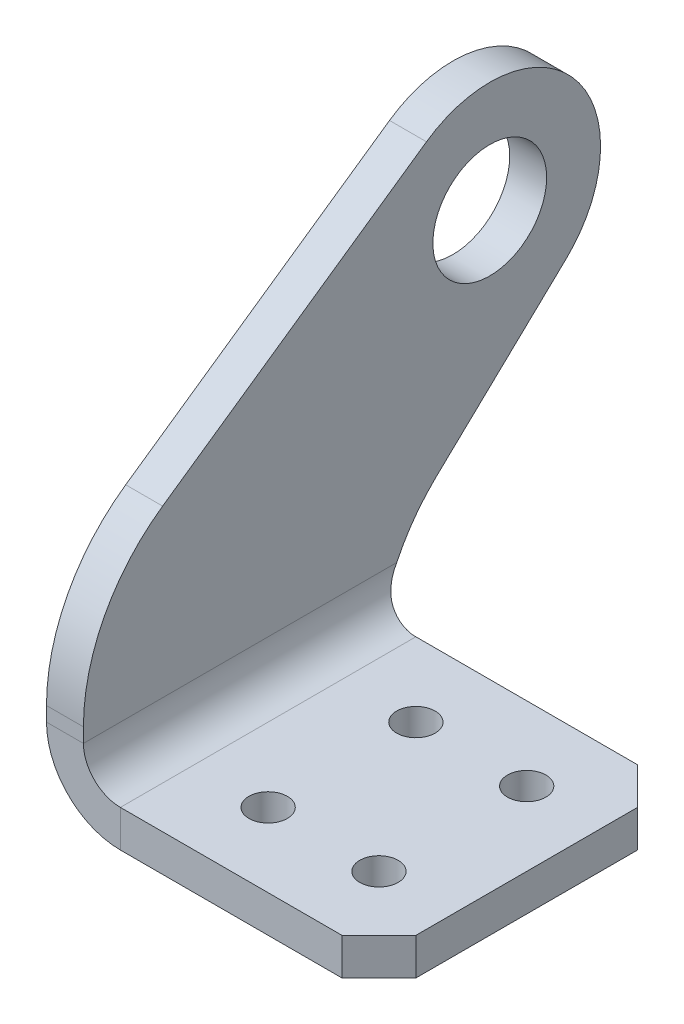
ISO-10303-21;
HEADER;
FILE_DESCRIPTION(('STEP AP214'),'2;1');
FILE_NAME('part.step','',(''),(''),'','','');
FILE_SCHEMA(('AUTOMOTIVE_DESIGN { 1 0 10303 214 1 1 1 1 }'));
ENDSEC;
DATA;
#1=APPLICATION_CONTEXT('core data for automotive mechanical design processes');
#2=APPLICATION_PROTOCOL_DEFINITION('international standard','automotive_design',2000,#1);
#3=PRODUCT_CONTEXT('',#1,'mechanical');
#4=PRODUCT('Part','Part','',(#3));
#5=PRODUCT_RELATED_PRODUCT_CATEGORY('part','',(#4));
#6=PRODUCT_DEFINITION_FORMATION('','',#4);
#7=PRODUCT_DEFINITION_CONTEXT('part definition',#1,'design');
#8=PRODUCT_DEFINITION('design','',#6,#7);
#9=PRODUCT_DEFINITION_SHAPE('','',#8);
#10=(LENGTH_UNIT() NAMED_UNIT(*) SI_UNIT(.MILLI.,.METRE.));
#11=(NAMED_UNIT(*) PLANE_ANGLE_UNIT() SI_UNIT($,.RADIAN.));
#12=(NAMED_UNIT(*) SI_UNIT($,.STERADIAN.) SOLID_ANGLE_UNIT());
#13=UNCERTAINTY_MEASURE_WITH_UNIT(LENGTH_MEASURE(1.E-05),#10,'distance_accuracy_value','');
#14=(GEOMETRIC_REPRESENTATION_CONTEXT(3) GLOBAL_UNCERTAINTY_ASSIGNED_CONTEXT((#13)) GLOBAL_UNIT_ASSIGNED_CONTEXT((#10,
#11,#12)) REPRESENTATION_CONTEXT('',''));
#15=CARTESIAN_POINT('',(0.,0.,0.));
#16=DIRECTION('',(0.,0.,1.));
#17=DIRECTION('',(1.,0.,0.));
#18=AXIS2_PLACEMENT_3D('',#15,#16,#17);
#19=CARTESIAN_POINT('',(3.175,0.,0.));
#20=DIRECTION('',(0.,0.,1.));
#21=DIRECTION('',(0.,-1.,0.));
#22=AXIS2_PLACEMENT_3D('',#19,#20,#21);
#23=PLANE('',#22);
#24=DIRECTION('',(0.,1.,0.));
#25=VECTOR('',#24,1.);
#26=CARTESIAN_POINT('',(0.,28.575,0.));
#27=LINE('',#26,#25);
#28=CARTESIAN_POINT('',(0.,7.58177696990121,0.));
#29=VERTEX_POINT('',#28);
#30=CARTESIAN_POINT('',(0.,6.35,0.));
#31=VERTEX_POINT('',#30);
#32=EDGE_CURVE('E224',#29,#31,#27,.F.);
#33=ORIENTED_EDGE('',*,*,#32,.T.);
#34=DIRECTION('',(1.,0.,0.));
#35=VECTOR('',#34,1.);
#36=CARTESIAN_POINT('',(3.175,6.35,0.));
#37=LINE('',#36,#35);
#38=CARTESIAN_POINT('',(3.175,6.35,0.));
#39=VERTEX_POINT('',#38);
#40=EDGE_CURVE('E12',#31,#39,#37,.T.);
#41=ORIENTED_EDGE('',*,*,#40,.T.);
#42=DIRECTION('',(0.,-1.,0.));
#43=VECTOR('',#42,1.);
#44=CARTESIAN_POINT('',(3.175,0.,0.));
#45=LINE('',#44,#43);
#46=CARTESIAN_POINT('',(3.175,7.58177696990121,0.));
#47=VERTEX_POINT('',#46);
#48=EDGE_CURVE('E198',#47,#39,#45,.T.);
#49=ORIENTED_EDGE('',*,*,#48,.F.);
#50=DIRECTION('',(1.,0.,0.));
#51=VECTOR('',#50,1.);
#52=CARTESIAN_POINT('',(3.175,7.58177696990121,0.));
#53=LINE('',#52,#51);
#54=EDGE_CURVE('E216',#29,#47,#53,.T.);
#55=ORIENTED_EDGE('',*,*,#54,.F.);
#56=EDGE_LOOP('',(#33,#41,#49,#55));
#57=FACE_BOUND('',#56,.T.);
#58=ADVANCED_FACE('F51',(#57),#23,.T.);
#59=CARTESIAN_POINT('',(3.175,15.875,0.));
#60=DIRECTION('',(0.,0.820808711597316,0.57120316785357));
#61=DIRECTION('',(0.,-0.57120316785357,0.820808711597316));
#62=AXIS2_PLACEMENT_3D('',#59,#60,#61);
#63=PLANE('',#62);
#64=DIRECTION('',(0.,-0.57120316785357,0.820808711597316));
#65=VECTOR('',#64,1.);
#66=CARTESIAN_POINT('',(3.175,15.875,0.));
#67=LINE('',#66,#65);
#68=CARTESIAN_POINT('',(3.175,36.3932029779644,-29.4842898261947));
#69=VERTEX_POINT('',#68);
#70=CARTESIAN_POINT('',(3.175,20.6121152665086,-6.80714971032458));
#71=VERTEX_POINT('',#70);
#72=EDGE_CURVE('E279',#69,#71,#67,.T.);
#73=ORIENTED_EDGE('',*,*,#72,.F.);
#74=DIRECTION('',(1.,0.,0.));
#75=VECTOR('',#74,1.);
#76=CARTESIAN_POINT('',(3.175,36.3932029779644,-29.4842898261947));
#77=LINE('',#76,#75);
#78=CARTESIAN_POINT('',(0.,36.3932029779644,-29.4842898261947));
#79=VERTEX_POINT('',#78);
#80=EDGE_CURVE('E251',#79,#69,#77,.T.);
#81=ORIENTED_EDGE('',*,*,#80,.F.);
#82=DIRECTION('',(0.,-0.57120316785357,0.820808711597316));
#83=VECTOR('',#82,1.);
#84=CARTESIAN_POINT('',(0.,15.875,0.));
#85=LINE('',#84,#83);
#86=CARTESIAN_POINT('',(0.,20.6121152665086,-6.80714971032458));
#87=VERTEX_POINT('',#86);
#88=EDGE_CURVE('E234',#79,#87,#85,.T.);
#89=ORIENTED_EDGE('',*,*,#88,.T.);
#90=DIRECTION('',(1.,0.,0.));
#91=VECTOR('',#90,1.);
#92=CARTESIAN_POINT('',(3.175,20.6121152665086,-6.80714971032458));
#93=LINE('',#92,#91);
#94=EDGE_CURVE('E200',#71,#87,#93,.F.);
#95=ORIENTED_EDGE('',*,*,#94,.F.);
#96=EDGE_LOOP('',(#73,#81,#89,#95));
#97=FACE_BOUND('',#96,.T.);
#98=ADVANCED_FACE('F263',(#97),#63,.T.);
#99=CARTESIAN_POINT('',(3.175,28.575,-34.925));
#100=DIRECTION('',(-1.,0.,0.));
#101=DIRECTION('',(0.,0.,-1.));
#102=AXIS2_PLACEMENT_3D('',#99,#100,#101);
#103=CYLINDRICAL_SURFACE('',#102,9.525);
#104=ORIENTED_EDGE('',*,*,#80,.T.);
#105=CARTESIAN_POINT('',(3.175,28.575,-34.925));
#106=DIRECTION('',(1.,0.,0.));
#107=DIRECTION('',(0.,0.,-1.));
#108=AXIS2_PLACEMENT_3D('',#105,#106,#107);
#109=CIRCLE('',#108,9.525);
#110=CARTESIAN_POINT('',(3.175,21.6775862068965,-41.4939655172414));
#111=VERTEX_POINT('',#110);
#112=EDGE_CURVE('E269',#111,#69,#109,.T.);
#113=ORIENTED_EDGE('',*,*,#112,.F.);
#114=DIRECTION('',(1.,0.,0.));
#115=VECTOR('',#114,1.);
#116=CARTESIAN_POINT('',(3.175,21.6775862068965,-41.4939655172414));
#117=LINE('',#116,#115);
#118=CARTESIAN_POINT('',(0.,21.6775862068965,-41.4939655172414));
#119=VERTEX_POINT('',#118);
#120=EDGE_CURVE('E248',#119,#111,#117,.T.);
#121=ORIENTED_EDGE('',*,*,#120,.F.);
#122=CARTESIAN_POINT('',(0.,28.575,-34.925));
#123=DIRECTION('',(1.,0.,0.));
#124=DIRECTION('',(0.,0.,-1.));
#125=AXIS2_PLACEMENT_3D('',#122,#123,#124);
#126=CIRCLE('',#125,9.525);
#127=EDGE_CURVE('E238',#119,#79,#126,.T.);
#128=ORIENTED_EDGE('',*,*,#127,.T.);
#129=EDGE_LOOP('',(#104,#113,#121,#128));
#130=FACE_BOUND('',#129,.T.);
#131=ADVANCED_FACE('F268',(#130),#103,.T.);
#132=CARTESIAN_POINT('',(3.175,6.35,-25.4));
#133=DIRECTION('',(0.,-0.724137931034483,-0.689655172413793));
#134=DIRECTION('',(0.,0.689655172413793,-0.724137931034483));
#135=AXIS2_PLACEMENT_3D('',#132,#133,#134);
#136=PLANE('',#135);
#137=DIRECTION('',(0.,0.689655172413793,-0.724137931034483));
#138=VECTOR('',#137,1.);
#139=CARTESIAN_POINT('',(0.,6.35,-25.4));
#140=LINE('',#139,#138);
#141=CARTESIAN_POINT('',(0.,11.042118226601,-30.326724137931));
#142=VERTEX_POINT('',#141);
#143=EDGE_CURVE('E247',#142,#119,#140,.T.);
#144=ORIENTED_EDGE('',*,*,#143,.T.);
#145=ORIENTED_EDGE('',*,*,#120,.T.);
#146=DIRECTION('',(0.,0.689655172413793,-0.724137931034483));
#147=VECTOR('',#146,1.);
#148=CARTESIAN_POINT('',(3.175,6.35,-25.4));
#149=LINE('',#148,#147);
#150=CARTESIAN_POINT('',(3.175,11.042118226601,-30.326724137931));
#151=VERTEX_POINT('',#150);
#152=EDGE_CURVE('E272',#151,#111,#149,.T.);
#153=ORIENTED_EDGE('',*,*,#152,.F.);
#154=DIRECTION('',(1.,0.,0.));
#155=VECTOR('',#154,1.);
#156=CARTESIAN_POINT('',(3.175,11.042118226601,-30.326724137931));
#157=LINE('',#156,#155);
#158=EDGE_CURVE('E190',#142,#151,#157,.T.);
#159=ORIENTED_EDGE('',*,*,#158,.F.);
#160=EDGE_LOOP('',(#144,#145,#153,#159));
#161=FACE_BOUND('',#160,.T.);
#162=ADVANCED_FACE('F271',(#161),#136,.T.);
#163=CARTESIAN_POINT('',(3.175,28.575,-34.925));
#164=DIRECTION('',(-1.,0.,0.));
#165=DIRECTION('',(0.,0.,-1.));
#166=AXIS2_PLACEMENT_3D('',#163,#164,#165);
#167=CYLINDRICAL_SURFACE('',#166,4.8895);
#168=CARTESIAN_POINT('',(3.175,28.575,-34.925));
#169=DIRECTION('',(1.,0.,0.));
#170=DIRECTION('',(0.,0.,-1.));
#171=AXIS2_PLACEMENT_3D('',#168,#169,#170);
#172=CIRCLE('',#171,4.8895);
#173=CARTESIAN_POINT('',(3.175,28.575,-39.8145));
#174=VERTEX_POINT('',#173);
#175=EDGE_CURVE('E252',#174,#174,#172,.T.);
#176=ORIENTED_EDGE('',*,*,#175,.T.);
#177=EDGE_LOOP('',(#176));
#178=FACE_BOUND('',#177,.T.);
#179=CARTESIAN_POINT('',(0.,28.575,-34.925));
#180=DIRECTION('',(1.,0.,0.));
#181=DIRECTION('',(0.,0.,-1.));
#182=AXIS2_PLACEMENT_3D('',#179,#180,#181);
#183=CIRCLE('',#182,4.8895);
#184=CARTESIAN_POINT('',(0.,28.575,-39.8145));
#185=VERTEX_POINT('',#184);
#186=EDGE_CURVE('E244',#185,#185,#183,.T.);
#187=ORIENTED_EDGE('',*,*,#186,.F.);
#188=EDGE_LOOP('',(#187));
#189=FACE_BOUND('',#188,.T.);
#190=ADVANCED_FACE('F477',(#178,#189),#167,.F.);
#191=CARTESIAN_POINT('',(3.175,28.575,-34.925));
#192=DIRECTION('',(-1.,0.,0.));
#193=DIRECTION('',(0.,0.,-1.));
#194=AXIS2_PLACEMENT_3D('',#191,#192,#193);
#195=PLANE('',#194);
#196=ORIENTED_EDGE('',*,*,#48,.T.);
#197=DIRECTION('',(0.,0.,1.));
#198=VECTOR('',#197,1.);
#199=CARTESIAN_POINT('',(3.175,6.35,-34.925));
#200=LINE('',#199,#198);
#201=CARTESIAN_POINT('',(3.175,6.35,-26.9318120413791));
#202=VERTEX_POINT('',#201);
#203=EDGE_CURVE('E162',#202,#39,#200,.T.);
#204=ORIENTED_EDGE('',*,*,#203,.F.);
#205=CARTESIAN_POINT('',(3.175,-0.453571428571434,-41.275));
#206=DIRECTION('',(1.,0.,0.));
#207=DIRECTION('',(0.,1.,0.));
#208=AXIS2_PLACEMENT_3D('',#205,#206,#207);
#209=CIRCLE('',#208,15.875);
#210=EDGE_CURVE('E188',#151,#202,#209,.T.);
#211=ORIENTED_EDGE('',*,*,#210,.F.);
#212=ORIENTED_EDGE('',*,*,#152,.T.);
#213=ORIENTED_EDGE('',*,*,#112,.T.);
#214=ORIENTED_EDGE('',*,*,#72,.T.);
#215=CARTESIAN_POINT('',(3.175,7.58177696990121,-15.875));
#216=DIRECTION('',(1.,0.,0.));
#217=DIRECTION('',(0.,1.,0.));
#218=AXIS2_PLACEMENT_3D('',#215,#216,#217);
#219=CIRCLE('',#218,15.875);
#220=EDGE_CURVE('E76',#47,#71,#219,.F.);
#221=ORIENTED_EDGE('',*,*,#220,.F.);
#222=EDGE_LOOP('',(#196,#204,#211,#212,#213,#214,#221));
#223=FACE_BOUND('',#222,.T.);
#224=ORIENTED_EDGE('',*,*,#175,.F.);
#225=EDGE_LOOP('',(#224));
#226=FACE_BOUND('',#225,.T.);
#227=ADVANCED_FACE('F195',(#223,#226),#195,.F.);
#228=CARTESIAN_POINT('',(0.,28.575,-34.925));
#229=DIRECTION('',(-1.,0.,0.));
#230=DIRECTION('',(0.,0.,-1.));
#231=AXIS2_PLACEMENT_3D('',#228,#229,#230);
#232=PLANE('',#231);
#233=ORIENTED_EDGE('',*,*,#88,.F.);
#234=ORIENTED_EDGE('',*,*,#127,.F.);
#235=ORIENTED_EDGE('',*,*,#143,.F.);
#236=CARTESIAN_POINT('',(0.,-0.453571428571434,-41.275));
#237=DIRECTION('',(1.,0.,0.));
#238=DIRECTION('',(0.,1.,0.));
#239=AXIS2_PLACEMENT_3D('',#236,#237,#238);
#240=CIRCLE('',#239,15.875);
#241=CARTESIAN_POINT('',(0.,6.35,-26.9318120413791));
#242=VERTEX_POINT('',#241);
#243=EDGE_CURVE('E193',#242,#142,#240,.F.);
#244=ORIENTED_EDGE('',*,*,#243,.F.);
#245=DIRECTION('',(0.,0.,1.));
#246=VECTOR('',#245,1.);
#247=CARTESIAN_POINT('',(0.,6.35,-34.925));
#248=LINE('',#247,#246);
#249=EDGE_CURVE('E61',#242,#31,#248,.T.);
#250=ORIENTED_EDGE('',*,*,#249,.T.);
#251=ORIENTED_EDGE('',*,*,#32,.F.);
#252=CARTESIAN_POINT('',(0.,7.58177696990121,-15.875));
#253=DIRECTION('',(1.,0.,0.));
#254=DIRECTION('',(0.,1.,0.));
#255=AXIS2_PLACEMENT_3D('',#252,#253,#254);
#256=CIRCLE('',#255,15.875);
#257=EDGE_CURVE('E69',#87,#29,#256,.T.);
#258=ORIENTED_EDGE('',*,*,#257,.F.);
#259=EDGE_LOOP('',(#233,#234,#235,#244,#250,#251,#258));
#260=FACE_BOUND('',#259,.T.);
#261=ORIENTED_EDGE('',*,*,#186,.T.);
#262=EDGE_LOOP('',(#261));
#263=FACE_BOUND('',#262,.T.);
#264=ADVANCED_FACE('F221',(#260,#263),#232,.T.);
#265=CARTESIAN_POINT('',(3.175,-0.453571428571434,-41.275));
#266=DIRECTION('',(-1.,0.,0.));
#267=DIRECTION('',(0.,1.,0.));
#268=AXIS2_PLACEMENT_3D('',#265,#266,#267);
#269=CYLINDRICAL_SURFACE('',#268,15.875);
#270=CARTESIAN_POINT('',(0.,6.35,-26.9318120413791));
#271=CARTESIAN_POINT('',(3.175,6.35,-26.9318120413791));
#272=B_SPLINE_CURVE_WITH_KNOTS('',1,(#270,#271),.UNSPECIFIED.,.F.,.F.,(2,2),(0.,1.),.UNSPECIFIED.);
#273=EDGE_CURVE('E175',#202,#242,#272,.F.);
#274=ORIENTED_EDGE('',*,*,#273,.T.);
#275=ORIENTED_EDGE('',*,*,#243,.T.);
#276=ORIENTED_EDGE('',*,*,#158,.T.);
#277=ORIENTED_EDGE('',*,*,#210,.T.);
#278=EDGE_LOOP('',(#274,#275,#276,#277));
#279=FACE_BOUND('',#278,.T.);
#280=ADVANCED_FACE('F53',(#279),#269,.F.);
#281=CARTESIAN_POINT('',(3.175,7.58177696990121,-15.875));
#282=DIRECTION('',(1.,0.,0.));
#283=DIRECTION('',(0.,-1.,0.));
#284=AXIS2_PLACEMENT_3D('',#281,#282,#283);
#285=CYLINDRICAL_SURFACE('',#284,15.875);
#286=ORIENTED_EDGE('',*,*,#257,.T.);
#287=ORIENTED_EDGE('',*,*,#54,.T.);
#288=ORIENTED_EDGE('',*,*,#220,.T.);
#289=ORIENTED_EDGE('',*,*,#94,.T.);
#290=EDGE_LOOP('',(#286,#287,#288,#289));
#291=FACE_BOUND('',#290,.T.);
#292=ADVANCED_FACE('F258',(#291),#285,.T.);
#293=CARTESIAN_POINT('',(25.4,3.175,0.));
#294=DIRECTION('',(0.707106781186547,0.,0.707106781186548));
#295=DIRECTION('',(-0.707106781186548,0.,0.707106781186547));
#296=AXIS2_PLACEMENT_3D('',#293,#294,#295);
#297=PLANE('',#296);
#298=DIRECTION('',(0.,1.,0.));
#299=VECTOR('',#298,1.);
#300=CARTESIAN_POINT('',(28.575,3.175,-3.175));
#301=LINE('',#300,#299);
#302=CARTESIAN_POINT('',(28.575,0.,-3.175));
#303=VERTEX_POINT('',#302);
#304=CARTESIAN_POINT('',(28.575,3.175,-3.175));
#305=VERTEX_POINT('',#304);
#306=EDGE_CURVE('E297',#303,#305,#301,.T.);
#307=ORIENTED_EDGE('',*,*,#306,.T.);
#308=DIRECTION('',(-0.707106781186548,0.,0.707106781186547));
#309=VECTOR('',#308,1.);
#310=CARTESIAN_POINT('',(25.4,3.175,0.));
#311=LINE('',#310,#309);
#312=CARTESIAN_POINT('',(25.4,3.175,0.));
#313=VERTEX_POINT('',#312);
#314=EDGE_CURVE('E328',#305,#313,#311,.T.);
#315=ORIENTED_EDGE('',*,*,#314,.T.);
#316=DIRECTION('',(0.,1.,0.));
#317=VECTOR('',#316,1.);
#318=CARTESIAN_POINT('',(25.4,3.175,0.));
#319=LINE('',#318,#317);
#320=CARTESIAN_POINT('',(25.4,0.,0.));
#321=VERTEX_POINT('',#320);
#322=EDGE_CURVE('E292',#321,#313,#319,.T.);
#323=ORIENTED_EDGE('',*,*,#322,.F.);
#324=DIRECTION('',(-0.707106781186548,0.,0.707106781186547));
#325=VECTOR('',#324,1.);
#326=CARTESIAN_POINT('',(25.4,0.,0.));
#327=LINE('',#326,#325);
#328=EDGE_CURVE('E289',#303,#321,#327,.T.);
#329=ORIENTED_EDGE('',*,*,#328,.F.);
#330=EDGE_LOOP('',(#307,#315,#323,#329));
#331=FACE_BOUND('',#330,.T.);
#332=ADVANCED_FACE('F450',(#331),#297,.T.);
#333=CARTESIAN_POINT('',(28.575,3.175,-3.175));
#334=DIRECTION('',(1.,0.,0.));
#335=DIRECTION('',(0.,0.,1.));
#336=AXIS2_PLACEMENT_3D('',#333,#334,#335);
#337=PLANE('',#336);
#338=DIRECTION('',(0.,1.,0.));
#339=VECTOR('',#338,1.);
#340=CARTESIAN_POINT('',(28.575,3.175,-22.225));
#341=LINE('',#340,#339);
#342=CARTESIAN_POINT('',(28.575,0.,-22.225));
#343=VERTEX_POINT('',#342);
#344=CARTESIAN_POINT('',(28.575,3.175,-22.225));
#345=VERTEX_POINT('',#344);
#346=EDGE_CURVE('E302',#343,#345,#341,.T.);
#347=ORIENTED_EDGE('',*,*,#346,.T.);
#348=DIRECTION('',(0.,0.,1.));
#349=VECTOR('',#348,1.);
#350=CARTESIAN_POINT('',(28.575,3.175,-3.175));
#351=LINE('',#350,#349);
#352=EDGE_CURVE('E326',#345,#305,#351,.T.);
#353=ORIENTED_EDGE('',*,*,#352,.T.);
#354=ORIENTED_EDGE('',*,*,#306,.F.);
#355=DIRECTION('',(0.,0.,1.));
#356=VECTOR('',#355,1.);
#357=CARTESIAN_POINT('',(28.575,0.,0.));
#358=LINE('',#357,#356);
#359=EDGE_CURVE('E295',#343,#303,#358,.T.);
#360=ORIENTED_EDGE('',*,*,#359,.F.);
#361=EDGE_LOOP('',(#347,#353,#354,#360));
#362=FACE_BOUND('',#361,.T.);
#363=ADVANCED_FACE('F447',(#362),#337,.T.);
#364=CARTESIAN_POINT('',(25.4,3.175,-25.4));
#365=DIRECTION('',(0.707106781186548,0.,-0.707106781186548));
#366=DIRECTION('',(0.707106781186547,0.,0.707106781186547));
#367=AXIS2_PLACEMENT_3D('',#364,#365,#366);
#368=PLANE('',#367);
#369=DIRECTION('',(0.,1.,0.));
#370=VECTOR('',#369,1.);
#371=CARTESIAN_POINT('',(25.4,3.175,-25.4));
#372=LINE('',#371,#370);
#373=CARTESIAN_POINT('',(25.4,0.,-25.4));
#374=VERTEX_POINT('',#373);
#375=CARTESIAN_POINT('',(25.4,3.175,-25.4));
#376=VERTEX_POINT('',#375);
#377=EDGE_CURVE('E333',#374,#376,#372,.T.);
#378=ORIENTED_EDGE('',*,*,#377,.T.);
#379=DIRECTION('',(0.707106781186547,0.,0.707106781186547));
#380=VECTOR('',#379,1.);
#381=CARTESIAN_POINT('',(25.4,3.175,-25.4));
#382=LINE('',#381,#380);
#383=EDGE_CURVE('E324',#376,#345,#382,.T.);
#384=ORIENTED_EDGE('',*,*,#383,.T.);
#385=ORIENTED_EDGE('',*,*,#346,.F.);
#386=DIRECTION('',(0.707106781186547,0.,0.707106781186547));
#387=VECTOR('',#386,1.);
#388=CARTESIAN_POINT('',(25.4,0.,-25.4));
#389=LINE('',#388,#387);
#390=EDGE_CURVE('E300',#374,#343,#389,.T.);
#391=ORIENTED_EDGE('',*,*,#390,.F.);
#392=EDGE_LOOP('',(#378,#384,#385,#391));
#393=FACE_BOUND('',#392,.T.);
#394=ADVANCED_FACE('F440',(#393),#368,.T.);
#395=CARTESIAN_POINT('',(22.225,3.175,-6.35));
#396=DIRECTION('',(0.,1.,0.));
#397=DIRECTION('',(0.,0.,1.));
#398=AXIS2_PLACEMENT_3D('',#395,#396,#397);
#399=CYLINDRICAL_SURFACE('',#398,1.651);
#400=CARTESIAN_POINT('',(22.225,0.,-6.35));
#401=DIRECTION('',(0.,-1.,0.));
#402=DIRECTION('',(0.,0.,1.));
#403=AXIS2_PLACEMENT_3D('',#400,#401,#402);
#404=CIRCLE('',#403,1.651);
#405=CARTESIAN_POINT('',(22.225,0.,-4.699));
#406=VERTEX_POINT('',#405);
#407=EDGE_CURVE('E345',#406,#406,#404,.T.);
#408=ORIENTED_EDGE('',*,*,#407,.T.);
#409=EDGE_LOOP('',(#408));
#410=FACE_BOUND('',#409,.T.);
#411=CARTESIAN_POINT('',(22.225,3.175,-6.35));
#412=DIRECTION('',(0.,-1.,0.));
#413=DIRECTION('',(0.,0.,1.));
#414=AXIS2_PLACEMENT_3D('',#411,#412,#413);
#415=CIRCLE('',#414,1.651);
#416=CARTESIAN_POINT('',(22.225,3.175,-4.699));
#417=VERTEX_POINT('',#416);
#418=EDGE_CURVE('E305',#417,#417,#415,.T.);
#419=ORIENTED_EDGE('',*,*,#418,.F.);
#420=EDGE_LOOP('',(#419));
#421=FACE_BOUND('',#420,.T.);
#422=ADVANCED_FACE('F567',(#410,#421),#399,.F.);
#423=CARTESIAN_POINT('',(12.7,3.175,-6.35));
#424=DIRECTION('',(0.,1.,0.));
#425=DIRECTION('',(0.,0.,1.));
#426=AXIS2_PLACEMENT_3D('',#423,#424,#425);
#427=CYLINDRICAL_SURFACE('',#426,1.651);
#428=CARTESIAN_POINT('',(12.7,0.,-6.35));
#429=DIRECTION('',(0.,-1.,0.));
#430=DIRECTION('',(0.,0.,1.));
#431=AXIS2_PLACEMENT_3D('',#428,#429,#430);
#432=CIRCLE('',#431,1.651);
#433=CARTESIAN_POINT('',(12.7,0.,-4.699));
#434=VERTEX_POINT('',#433);
#435=EDGE_CURVE('E342',#434,#434,#432,.T.);
#436=ORIENTED_EDGE('',*,*,#435,.T.);
#437=EDGE_LOOP('',(#436));
#438=FACE_BOUND('',#437,.T.);
#439=CARTESIAN_POINT('',(12.7,3.175,-6.35));
#440=DIRECTION('',(0.,-1.,0.));
#441=DIRECTION('',(0.,0.,1.));
#442=AXIS2_PLACEMENT_3D('',#439,#440,#441);
#443=CIRCLE('',#442,1.651);
#444=CARTESIAN_POINT('',(12.7,3.175,-4.699));
#445=VERTEX_POINT('',#444);
#446=EDGE_CURVE('E308',#445,#445,#443,.T.);
#447=ORIENTED_EDGE('',*,*,#446,.F.);
#448=EDGE_LOOP('',(#447));
#449=FACE_BOUND('',#448,.T.);
#450=ADVANCED_FACE('F581',(#438,#449),#427,.F.);
#451=CARTESIAN_POINT('',(12.7,3.175,-19.05));
#452=DIRECTION('',(0.,1.,0.));
#453=DIRECTION('',(0.,0.,1.));
#454=AXIS2_PLACEMENT_3D('',#451,#452,#453);
#455=CYLINDRICAL_SURFACE('',#454,1.651);
#456=CARTESIAN_POINT('',(12.7,0.,-19.05));
#457=DIRECTION('',(0.,-1.,0.));
#458=DIRECTION('',(0.,0.,1.));
#459=AXIS2_PLACEMENT_3D('',#456,#457,#458);
#460=CIRCLE('',#459,1.651);
#461=CARTESIAN_POINT('',(12.7,0.,-17.399));
#462=VERTEX_POINT('',#461);
#463=EDGE_CURVE('E339',#462,#462,#460,.T.);
#464=ORIENTED_EDGE('',*,*,#463,.T.);
#465=EDGE_LOOP('',(#464));
#466=FACE_BOUND('',#465,.T.);
#467=CARTESIAN_POINT('',(12.7,3.175,-19.05));
#468=DIRECTION('',(0.,-1.,0.));
#469=DIRECTION('',(0.,0.,1.));
#470=AXIS2_PLACEMENT_3D('',#467,#468,#469);
#471=CIRCLE('',#470,1.651);
#472=CARTESIAN_POINT('',(12.7,3.175,-17.399));
#473=VERTEX_POINT('',#472);
#474=EDGE_CURVE('E311',#473,#473,#471,.T.);
#475=ORIENTED_EDGE('',*,*,#474,.F.);
#476=EDGE_LOOP('',(#475));
#477=FACE_BOUND('',#476,.T.);
#478=ADVANCED_FACE('F465',(#466,#477),#455,.F.);
#479=CARTESIAN_POINT('',(22.225,3.175,-19.05));
#480=DIRECTION('',(0.,1.,0.));
#481=DIRECTION('',(0.,0.,1.));
#482=AXIS2_PLACEMENT_3D('',#479,#480,#481);
#483=CYLINDRICAL_SURFACE('',#482,1.651);
#484=CARTESIAN_POINT('',(22.225,0.,-19.05));
#485=DIRECTION('',(0.,-1.,0.));
#486=DIRECTION('',(0.,0.,1.));
#487=AXIS2_PLACEMENT_3D('',#484,#485,#486);
#488=CIRCLE('',#487,1.651);
#489=CARTESIAN_POINT('',(22.225,0.,-17.399));
#490=VERTEX_POINT('',#489);
#491=EDGE_CURVE('E336',#490,#490,#488,.T.);
#492=ORIENTED_EDGE('',*,*,#491,.T.);
#493=EDGE_LOOP('',(#492));
#494=FACE_BOUND('',#493,.T.);
#495=CARTESIAN_POINT('',(22.225,3.175,-19.05));
#496=DIRECTION('',(0.,-1.,0.));
#497=DIRECTION('',(0.,0.,1.));
#498=AXIS2_PLACEMENT_3D('',#495,#496,#497);
#499=CIRCLE('',#498,1.651);
#500=CARTESIAN_POINT('',(22.225,3.175,-17.399));
#501=VERTEX_POINT('',#500);
#502=EDGE_CURVE('E314',#501,#501,#499,.T.);
#503=ORIENTED_EDGE('',*,*,#502,.F.);
#504=EDGE_LOOP('',(#503));
#505=FACE_BOUND('',#504,.T.);
#506=ADVANCED_FACE('F457',(#494,#505),#483,.F.);
#507=CARTESIAN_POINT('',(0.,3.175,0.));
#508=DIRECTION('',(0.,1.,0.));
#509=DIRECTION('',(0.,0.,1.));
#510=AXIS2_PLACEMENT_3D('',#507,#508,#509);
#511=PLANE('',#510);
#512=ORIENTED_EDGE('',*,*,#502,.T.);
#513=EDGE_LOOP('',(#512));
#514=FACE_BOUND('',#513,.T.);
#515=ORIENTED_EDGE('',*,*,#474,.T.);
#516=EDGE_LOOP('',(#515));
#517=FACE_BOUND('',#516,.T.);
#518=ORIENTED_EDGE('',*,*,#446,.T.);
#519=EDGE_LOOP('',(#518));
#520=FACE_BOUND('',#519,.T.);
#521=ORIENTED_EDGE('',*,*,#418,.T.);
#522=EDGE_LOOP('',(#521));
#523=FACE_BOUND('',#522,.T.);
#524=DIRECTION('',(-1.,0.,0.));
#525=VECTOR('',#524,1.);
#526=CARTESIAN_POINT('',(0.,3.175,0.));
#527=LINE('',#526,#525);
#528=CARTESIAN_POINT('',(6.35,3.175,0.));
#529=VERTEX_POINT('',#528);
#530=EDGE_CURVE('E317',#313,#529,#527,.T.);
#531=ORIENTED_EDGE('',*,*,#530,.F.);
#532=ORIENTED_EDGE('',*,*,#314,.F.);
#533=ORIENTED_EDGE('',*,*,#352,.F.);
#534=ORIENTED_EDGE('',*,*,#383,.F.);
#535=DIRECTION('',(1.,0.,0.));
#536=VECTOR('',#535,1.);
#537=CARTESIAN_POINT('',(0.,3.175,-25.4));
#538=LINE('',#537,#536);
#539=CARTESIAN_POINT('',(6.35,3.175,-25.4));
#540=VERTEX_POINT('',#539);
#541=EDGE_CURVE('E322',#540,#376,#538,.T.);
#542=ORIENTED_EDGE('',*,*,#541,.F.);
#543=DIRECTION('',(0.,0.,-1.));
#544=VECTOR('',#543,1.);
#545=CARTESIAN_POINT('',(6.35,3.175,0.));
#546=LINE('',#545,#544);
#547=EDGE_CURVE('E320',#529,#540,#546,.T.);
#548=ORIENTED_EDGE('',*,*,#547,.F.);
#549=EDGE_LOOP('',(#531,#532,#533,#534,#542,#548));
#550=FACE_BOUND('',#549,.T.);
#551=ADVANCED_FACE('F455',(#514,#517,#520,#523,#550),#511,.T.);
#552=CARTESIAN_POINT('',(0.,3.175,-25.4));
#553=DIRECTION('',(0.,0.,-1.));
#554=DIRECTION('',(1.,0.,0.));
#555=AXIS2_PLACEMENT_3D('',#552,#553,#554);
#556=PLANE('',#555);
#557=DIRECTION('',(0.,1.,0.));
#558=VECTOR('',#557,1.);
#559=CARTESIAN_POINT('',(6.35,3.175,-25.4));
#560=LINE('',#559,#558);
#561=CARTESIAN_POINT('',(6.35,0.,-25.4));
#562=VERTEX_POINT('',#561);
#563=EDGE_CURVE('E285',#562,#540,#560,.T.);
#564=ORIENTED_EDGE('',*,*,#563,.T.);
#565=ORIENTED_EDGE('',*,*,#541,.T.);
#566=ORIENTED_EDGE('',*,*,#377,.F.);
#567=DIRECTION('',(-1.,0.,0.));
#568=VECTOR('',#567,1.);
#569=CARTESIAN_POINT('',(0.,0.,-25.4));
#570=LINE('',#569,#568);
#571=EDGE_CURVE('E331',#562,#374,#570,.F.);
#572=ORIENTED_EDGE('',*,*,#571,.F.);
#573=EDGE_LOOP('',(#564,#565,#566,#572));
#574=FACE_BOUND('',#573,.T.);
#575=ADVANCED_FACE('F436',(#574),#556,.T.);
#576=CARTESIAN_POINT('',(0.,0.,0.));
#577=DIRECTION('',(0.,1.,0.));
#578=DIRECTION('',(0.,0.,1.));
#579=AXIS2_PLACEMENT_3D('',#576,#577,#578);
#580=PLANE('',#579);
#581=ORIENTED_EDGE('',*,*,#491,.F.);
#582=EDGE_LOOP('',(#581));
#583=FACE_BOUND('',#582,.T.);
#584=ORIENTED_EDGE('',*,*,#463,.F.);
#585=EDGE_LOOP('',(#584));
#586=FACE_BOUND('',#585,.T.);
#587=ORIENTED_EDGE('',*,*,#435,.F.);
#588=EDGE_LOOP('',(#587));
#589=FACE_BOUND('',#588,.T.);
#590=ORIENTED_EDGE('',*,*,#407,.F.);
#591=EDGE_LOOP('',(#590));
#592=FACE_BOUND('',#591,.T.);
#593=DIRECTION('',(-1.,0.,0.));
#594=VECTOR('',#593,1.);
#595=CARTESIAN_POINT('',(0.,0.,0.));
#596=LINE('',#595,#594);
#597=CARTESIAN_POINT('',(6.35,0.,0.));
#598=VERTEX_POINT('',#597);
#599=EDGE_CURVE('E240',#321,#598,#596,.T.);
#600=ORIENTED_EDGE('',*,*,#599,.T.);
#601=DIRECTION('',(0.,0.,-1.));
#602=VECTOR('',#601,1.);
#603=CARTESIAN_POINT('',(6.35,0.,0.));
#604=LINE('',#603,#602);
#605=EDGE_CURVE('E282',#598,#562,#604,.T.);
#606=ORIENTED_EDGE('',*,*,#605,.T.);
#607=ORIENTED_EDGE('',*,*,#571,.T.);
#608=ORIENTED_EDGE('',*,*,#390,.T.);
#609=ORIENTED_EDGE('',*,*,#359,.T.);
#610=ORIENTED_EDGE('',*,*,#328,.T.);
#611=EDGE_LOOP('',(#600,#606,#607,#608,#609,#610));
#612=FACE_BOUND('',#611,.T.);
#613=ADVANCED_FACE('F432',(#583,#586,#589,#592,#612),#580,.F.);
#614=CARTESIAN_POINT('',(0.,3.175,0.));
#615=DIRECTION('',(0.,0.,1.));
#616=DIRECTION('',(-1.,0.,0.));
#617=AXIS2_PLACEMENT_3D('',#614,#615,#616);
#618=PLANE('',#617);
#619=ORIENTED_EDGE('',*,*,#322,.T.);
#620=ORIENTED_EDGE('',*,*,#530,.T.);
#621=DIRECTION('',(0.,1.,0.));
#622=VECTOR('',#621,1.);
#623=CARTESIAN_POINT('',(6.35,3.175,0.));
#624=LINE('',#623,#622);
#625=EDGE_CURVE('E235',#598,#529,#624,.T.);
#626=ORIENTED_EDGE('',*,*,#625,.F.);
#627=ORIENTED_EDGE('',*,*,#599,.F.);
#628=EDGE_LOOP('',(#619,#620,#626,#627));
#629=FACE_BOUND('',#628,.T.);
#630=ADVANCED_FACE('F364',(#629),#618,.T.);
#631=CARTESIAN_POINT('',(0.,6.35,-26.9318120413791));
#632=CARTESIAN_POINT('',(0.,5.45499893340961,-26.64919112922));
#633=CARTESIAN_POINT('',(0.187472928882348,4.65935693206345,-26.4147735948898));
#634=CARTESIAN_POINT('',(0.585807297083014,3.66211775648681,-26.1324029179121));
#635=CARTESIAN_POINT('',(0.738314159765192,3.36170665431008,-26.0499913764628));
#636=CARTESIAN_POINT('',(0.979717542468794,2.95777799979435,-25.9439420906037));
#637=CARTESIAN_POINT('',(1.06232558452166,2.83087286066945,-25.9115203330365));
#638=CARTESIAN_POINT('',(1.18763967382208,2.6516422564301,-25.8672797032643));
#639=CARTESIAN_POINT('',(1.22964692518345,2.59375146496442,-25.8532648277701));
#640=CARTESIAN_POINT('',(1.2928055141279,2.50962064386864,-25.8333405161734));
#641=CARTESIAN_POINT('',(1.31388313385523,2.48202784689022,-25.8268820792486));
#642=CARTESIAN_POINT('',(1.34551217002036,2.44130495225571,-25.8174689242726));
#643=CARTESIAN_POINT('',(1.35605729172273,2.42784169969176,-25.8143769560158));
#644=CARTESIAN_POINT('',(1.37714776858971,2.40113558212107,-25.8082845196392));
#645=CARTESIAN_POINT('',(1.38643890187405,2.38945504001286,-25.8056355351374));
#646=CARTESIAN_POINT('',(1.77576414997602,1.90449159093965,-25.6965308800552));
#647=CARTESIAN_POINT('',(2.28340663010444,1.40844753653823,-25.610104208893));
#648=CARTESIAN_POINT('',(3.62896279716589,0.557584361769577,-25.4759944310703));
#649=CARTESIAN_POINT('',(4.46778467167119,0.204748162061876,-25.4284028246094));
#650=CARTESIAN_POINT('',(5.44991355242225,0.0641154650370119,-25.4));
#651=CARTESIAN_POINT('',(3.175,6.35,-26.9318120413791));
#652=CARTESIAN_POINT('',(3.175,5.90272892584521,-26.6493360451402));
#653=CARTESIAN_POINT('',(3.26873646444117,5.50467846603173,-26.4147735948898));
#654=CARTESIAN_POINT('',(3.46790364854151,5.0060588782434,-26.1324029179121));
#655=CARTESIAN_POINT('',(3.5441570798826,4.85585332715504,-26.0499913764628));
#656=CARTESIAN_POINT('',(3.6648587712344,4.65388899989718,-25.9439420906037));
#657=CARTESIAN_POINT('',(3.70616279226083,4.59043643033473,-25.9115203330364));
#658=CARTESIAN_POINT('',(3.76881983691104,4.50082112821505,-25.8672797032643));
#659=CARTESIAN_POINT('',(3.78982346259172,4.47187573248221,-25.8532648277701));
#660=CARTESIAN_POINT('',(3.82140275706395,4.42981032193432,-25.8333405161734));
#661=CARTESIAN_POINT('',(3.83194156692762,4.41601392344511,-25.8268820792486));
#662=CARTESIAN_POINT('',(3.84775608501018,4.39565247612785,-25.8174689242726));
#663=CARTESIAN_POINT('',(3.85302864586136,4.38892084984588,-25.8143769560158));
#664=CARTESIAN_POINT('',(3.86357388429486,4.37556779106054,-25.8082845196392));
#665=CARTESIAN_POINT('',(3.86821945093703,4.36972752000643,-25.8056355351374));
#666=CARTESIAN_POINT('',(4.06288207498801,4.12724579546983,-25.6965308800552));
#667=CARTESIAN_POINT('',(4.31670331505222,3.87922376826912,-25.610104208893));
#668=CARTESIAN_POINT('',(4.98948139858294,3.45379218088479,-25.4759944310703));
#669=CARTESIAN_POINT('',(5.40889621260827,3.2773735259093,-25.4284026003796));
#670=CARTESIAN_POINT('',(5.89995677621112,3.20705773251851,-25.4));
#671=B_SPLINE_SURFACE_WITH_KNOTS('',1,3,((#631,#632,#633,#634,#635,#636,#637,#638,#639,#640,
#641,#642,#643,#644,#645,#646,#647,#648,#649,#650),(#651,#652,#653,#654,#655,#656,#657,#658,
#659,#660,#661,#662,#663,#664,#665,#666,#667,#668,#669,#670)),.UNSPECIFIED.,.F.,.F.,.F.,(2,2),
(4,2,2,2,2,2,2,2,2,4),(0.,1.),(0.,0.25,0.375,0.4375,0.46875,0.484375,0.4921875,0.5,0.75,1.),.UNSPECIFIED.);
#672=CARTESIAN_POINT('',(3.175,6.35,-26.9318120413791));
#673=CARTESIAN_POINT('',(3.175,5.90272892584521,-26.6493360451402));
#674=CARTESIAN_POINT('',(3.26873646444117,5.50467846603173,-26.4147735948898));
#675=CARTESIAN_POINT('',(3.46790364854151,5.0060588782434,-26.1324029179121));
#676=CARTESIAN_POINT('',(3.5441570798826,4.85585332715504,-26.0499913764628));
#677=CARTESIAN_POINT('',(3.6648587712344,4.65388899989718,-25.9439420906037));
#678=CARTESIAN_POINT('',(3.70616279226083,4.59043643033473,-25.9115203330364));
#679=CARTESIAN_POINT('',(3.76881983691104,4.50082112821505,-25.8672797032643));
#680=CARTESIAN_POINT('',(3.78982346259172,4.47187573248221,-25.8532648277701));
#681=CARTESIAN_POINT('',(3.82140275706395,4.42981032193432,-25.8333405161734));
#682=CARTESIAN_POINT('',(3.83194156692762,4.41601392344511,-25.8268820792486));
#683=CARTESIAN_POINT('',(3.84775608501018,4.39565247612785,-25.8174689242726));
#684=CARTESIAN_POINT('',(3.85302864586136,4.38892084984588,-25.8143769560158));
#685=CARTESIAN_POINT('',(3.86357388429486,4.37556779106054,-25.8082845196392));
#686=CARTESIAN_POINT('',(3.86821945093703,4.36972752000643,-25.8056355351374));
#687=CARTESIAN_POINT('',(4.06288207498801,4.12724579546983,-25.6965308800552));
#688=CARTESIAN_POINT('',(4.31670331505222,3.87922376826912,-25.610104208893));
#689=CARTESIAN_POINT('',(4.98948139858294,3.45379218088479,-25.4759944310703));
#690=CARTESIAN_POINT('',(5.40889621260827,3.2773735259093,-25.4284026003796));
#691=CARTESIAN_POINT('',(5.89995677621112,3.20705773251851,-25.4));
#692=B_SPLINE_CURVE_WITH_KNOTS('',3,(#672,#673,#674,#675,#676,#677,#678,#679,#680,#681,#682,
#683,#684,#685,#686,#687,#688,#689,#690,#691),.UNSPECIFIED.,.F.,.F.,(4,2,2,2,2,2,2,2,2,4),(0.,
0.25,0.375,0.4375,0.46875,0.484375,0.4921875,0.5,0.75,1.),.UNSPECIFIED.);
#693=CARTESIAN_POINT('',(5.89995677621112,3.20705773251851,-25.4));
#694=VERTEX_POINT('',#693);
#695=EDGE_CURVE('E156',#202,#694,#692,.T.);
#696=CARTESIAN_POINT('',(5.89995677621112,3.20705773251851,-25.4));
#697=CARTESIAN_POINT('',(5.44991355242225,0.0641154650370119,-25.4));
#698=B_SPLINE_CURVE_WITH_KNOTS('',1,(#696,#697),.UNSPECIFIED.,.F.,.F.,(2,2),(0.,1.),.UNSPECIFIED.);
#699=CARTESIAN_POINT('',(5.44991355242225,0.0641154650370124,-25.4));
#700=VERTEX_POINT('',#699);
#701=EDGE_CURVE('E286',#700,#694,#698,.F.);
#702=CARTESIAN_POINT('',(5.44991355242225,0.0641154650370119,-25.4));
#703=CARTESIAN_POINT('',(4.46778467167119,0.204748162061876,-25.4284028246094));
#704=CARTESIAN_POINT('',(3.62896279716589,0.557584361769577,-25.4759944310703));
#705=CARTESIAN_POINT('',(2.28340663010444,1.40844753653823,-25.610104208893));
#706=CARTESIAN_POINT('',(1.77576414997602,1.90449159093965,-25.6965308800552));
#707=CARTESIAN_POINT('',(1.38643890187405,2.38945504001286,-25.8056355351374));
#708=CARTESIAN_POINT('',(1.37714776858971,2.40113558212107,-25.8082845196392));
#709=CARTESIAN_POINT('',(1.35605729172273,2.42784169969176,-25.8143769560158));
#710=CARTESIAN_POINT('',(1.34551217002036,2.44130495225571,-25.8174689242726));
#711=CARTESIAN_POINT('',(1.31388313385523,2.48202784689022,-25.8268820792486));
#712=CARTESIAN_POINT('',(1.2928055141279,2.50962064386864,-25.8333405161734));
#713=CARTESIAN_POINT('',(1.22964692518345,2.59375146496442,-25.8532648277701));
#714=CARTESIAN_POINT('',(1.18763967382208,2.6516422564301,-25.8672797032643));
#715=CARTESIAN_POINT('',(1.06232558452166,2.83087286066945,-25.9115203330365));
#716=CARTESIAN_POINT('',(0.979717542468794,2.95777799979435,-25.9439420906037));
#717=CARTESIAN_POINT('',(0.738314159765192,3.36170665431008,-26.0499913764628));
#718=CARTESIAN_POINT('',(0.585807297083014,3.66211775648681,-26.1324029179121));
#719=CARTESIAN_POINT('',(0.187472928882348,4.65935693206345,-26.4147735948898));
#720=CARTESIAN_POINT('',(0.,5.45499893340961,-26.64919112922));
#721=CARTESIAN_POINT('',(0.,6.35,-26.9318120413791));
#722=B_SPLINE_CURVE_WITH_KNOTS('',3,(#702,#703,#704,#705,#706,#707,#708,#709,#710,#711,#712,
#713,#714,#715,#716,#717,#718,#719,#720,#721),.UNSPECIFIED.,.F.,.F.,(4,2,2,2,2,2,2,2,2,4),(0.,
0.25,0.5,0.5078125,0.515625,0.53125,0.5625,0.625,0.75,1.),.UNSPECIFIED.);
#723=EDGE_CURVE('E180',#242,#700,#722,.F.);
#724=ORIENTED_EDGE('',*,*,#273,.F.);
#725=ORIENTED_EDGE('',*,*,#695,.T.);
#726=ORIENTED_EDGE('',*,*,#701,.F.);
#727=ORIENTED_EDGE('',*,*,#723,.F.);
#728=EDGE_LOOP('',(#724,#725,#726,#727));
#729=FACE_BOUND('',#728,.T.);
#730=ADVANCED_FACE('F178',(#729),#671,.T.);
#731=CARTESIAN_POINT('',(6.35,6.35,-25.4));
#732=DIRECTION('',(0.,0.,1.));
#733=DIRECTION('',(-1.,0.,0.));
#734=AXIS2_PLACEMENT_3D('',#731,#732,#733);
#735=PLANE('',#734);
#736=ORIENTED_EDGE('',*,*,#701,.T.);
#737=CARTESIAN_POINT('',(6.35,6.35,-25.4));
#738=DIRECTION('',(0.,0.,1.));
#739=DIRECTION('',(1.,0.,0.));
#740=AXIS2_PLACEMENT_3D('',#737,#738,#739);
#741=CIRCLE('',#740,3.175);
#742=EDGE_CURVE('E164',#694,#540,#741,.T.);
#743=ORIENTED_EDGE('',*,*,#742,.T.);
#744=ORIENTED_EDGE('',*,*,#563,.F.);
#745=CARTESIAN_POINT('',(6.35,6.35,-25.4));
#746=DIRECTION('',(0.,0.,1.));
#747=DIRECTION('',(1.,0.,0.));
#748=AXIS2_PLACEMENT_3D('',#745,#746,#747);
#749=CIRCLE('',#748,6.35);
#750=EDGE_CURVE('E401',#700,#562,#749,.T.);
#751=ORIENTED_EDGE('',*,*,#750,.F.);
#752=EDGE_LOOP('',(#736,#743,#744,#751));
#753=FACE_BOUND('',#752,.T.);
#754=ADVANCED_FACE('F363',(#753),#735,.F.);
#755=CARTESIAN_POINT('',(6.35,6.35,0.));
#756=DIRECTION('',(0.,0.,-1.));
#757=DIRECTION('',(0.,1.,0.));
#758=AXIS2_PLACEMENT_3D('',#755,#756,#757);
#759=PLANE('',#758);
#760=CARTESIAN_POINT('',(6.35,6.35,0.));
#761=DIRECTION('',(0.,0.,1.));
#762=DIRECTION('',(1.,0.,0.));
#763=AXIS2_PLACEMENT_3D('',#760,#761,#762);
#764=CIRCLE('',#763,6.35);
#765=EDGE_CURVE('E170',#598,#31,#764,.F.);
#766=ORIENTED_EDGE('',*,*,#765,.F.);
#767=ORIENTED_EDGE('',*,*,#625,.T.);
#768=CARTESIAN_POINT('',(6.35,6.35,0.));
#769=DIRECTION('',(0.,0.,-1.));
#770=DIRECTION('',(0.,-1.,0.));
#771=AXIS2_PLACEMENT_3D('',#768,#769,#770);
#772=CIRCLE('',#771,3.175);
#773=EDGE_CURVE('E231',#529,#39,#772,.T.);
#774=ORIENTED_EDGE('',*,*,#773,.T.);
#775=ORIENTED_EDGE('',*,*,#40,.F.);
#776=EDGE_LOOP('',(#766,#767,#774,#775));
#777=FACE_BOUND('',#776,.T.);
#778=ADVANCED_FACE('F228',(#777),#759,.F.);
#779=CARTESIAN_POINT('',(6.35,6.35,15.4312504444639));
#780=DIRECTION('',(0.,0.,-1.));
#781=DIRECTION('',(1.,0.,0.));
#782=AXIS2_PLACEMENT_3D('',#779,#780,#781);
#783=CYLINDRICAL_SURFACE('',#782,3.175);
#784=ORIENTED_EDGE('',*,*,#547,.T.);
#785=ORIENTED_EDGE('',*,*,#742,.F.);
#786=ORIENTED_EDGE('',*,*,#695,.F.);
#787=ORIENTED_EDGE('',*,*,#203,.T.);
#788=ORIENTED_EDGE('',*,*,#773,.F.);
#789=EDGE_LOOP('',(#784,#785,#786,#787,#788));
#790=FACE_BOUND('',#789,.T.);
#791=ADVANCED_FACE('F160',(#790),#783,.F.);
#792=CARTESIAN_POINT('',(6.35,6.35,15.4312504444639));
#793=DIRECTION('',(0.,0.,-1.));
#794=DIRECTION('',(1.,0.,0.));
#795=AXIS2_PLACEMENT_3D('',#792,#793,#794);
#796=CYLINDRICAL_SURFACE('',#795,6.35);
#797=ORIENTED_EDGE('',*,*,#605,.F.);
#798=ORIENTED_EDGE('',*,*,#765,.T.);
#799=ORIENTED_EDGE('',*,*,#249,.F.);
#800=ORIENTED_EDGE('',*,*,#723,.T.);
#801=ORIENTED_EDGE('',*,*,#750,.T.);
#802=EDGE_LOOP('',(#797,#798,#799,#800,#801));
#803=FACE_BOUND('',#802,.T.);
#804=ADVANCED_FACE('F418',(#803),#796,.T.);
#805=CLOSED_SHELL('',(#58,#98,#131,#162,#190,#227,#264,#280,#292,#332,#363,#394,#422,#450,#478,
#506,#551,#575,#613,#630,#730,#754,#778,#791,#804));
#806=MANIFOLD_SOLID_BREP('B2',#805);
#807=ADVANCED_BREP_SHAPE_REPRESENTATION('',(#18,#806),#14);
#808=SHAPE_DEFINITION_REPRESENTATION(#9,#807);
ENDSEC;
END-ISO-10303-21;
